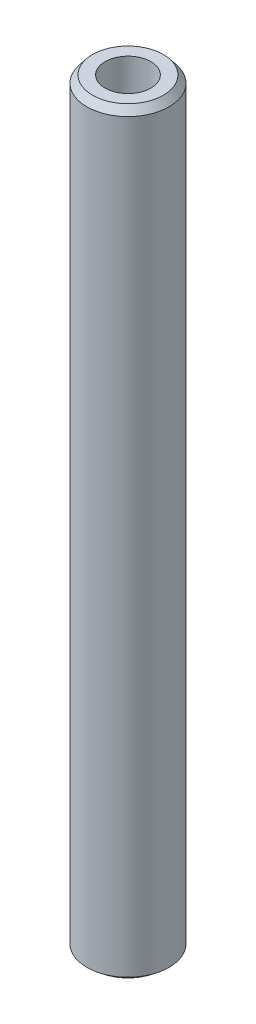
ISO-10303-21;
HEADER;
FILE_DESCRIPTION(('STEP AP214'),'2;1');
FILE_NAME('part.step','',(''),(''),'','','');
FILE_SCHEMA(('AUTOMOTIVE_DESIGN { 1 0 10303 214 1 1 1 1 }'));
ENDSEC;
DATA;
#1=APPLICATION_CONTEXT('core data for automotive mechanical design processes');
#2=APPLICATION_PROTOCOL_DEFINITION('international standard','automotive_design',2000,#1);
#3=PRODUCT_CONTEXT('',#1,'mechanical');
#4=PRODUCT('Part','Part','',(#3));
#5=PRODUCT_RELATED_PRODUCT_CATEGORY('part','',(#4));
#6=PRODUCT_DEFINITION_FORMATION('','',#4);
#7=PRODUCT_DEFINITION_CONTEXT('part definition',#1,'design');
#8=PRODUCT_DEFINITION('design','',#6,#7);
#9=PRODUCT_DEFINITION_SHAPE('','',#8);
#10=(LENGTH_UNIT() NAMED_UNIT(*) SI_UNIT(.MILLI.,.METRE.));
#11=(NAMED_UNIT(*) PLANE_ANGLE_UNIT() SI_UNIT($,.RADIAN.));
#12=(NAMED_UNIT(*) SI_UNIT($,.STERADIAN.) SOLID_ANGLE_UNIT());
#13=UNCERTAINTY_MEASURE_WITH_UNIT(LENGTH_MEASURE(1.E-05),#10,'distance_accuracy_value','');
#14=(GEOMETRIC_REPRESENTATION_CONTEXT(3) GLOBAL_UNCERTAINTY_ASSIGNED_CONTEXT((#13)) GLOBAL_UNIT_ASSIGNED_CONTEXT((#10,
#11,#12)) REPRESENTATION_CONTEXT('',''));
#15=CARTESIAN_POINT('',(0.,0.,0.));
#16=DIRECTION('',(0.,0.,1.));
#17=DIRECTION('',(1.,0.,0.));
#18=AXIS2_PLACEMENT_3D('',#15,#16,#17);
#19=CARTESIAN_POINT('',(0.,600.,0.));
#20=DIRECTION('',(0.,-1.,0.));
#21=DIRECTION('',(0.,0.,-1.));
#22=AXIS2_PLACEMENT_3D('',#19,#20,#21);
#23=CYLINDRICAL_SURFACE('',#22,32.5);
#24=CARTESIAN_POINT('',(0.,594.346347085469,0.));
#25=DIRECTION('',(0.,1.,0.));
#26=DIRECTION('',(0.,0.,1.));
#27=AXIS2_PLACEMENT_3D('',#24,#25,#26);
#28=CIRCLE('',#27,32.5);
#29=CARTESIAN_POINT('',(0.,594.346347085469,32.5));
#30=VERTEX_POINT('',#29);
#31=EDGE_CURVE('E50',#30,#30,#28,.F.);
#32=ORIENTED_EDGE('',*,*,#31,.T.);
#33=EDGE_LOOP('',(#32));
#34=FACE_BOUND('',#33,.T.);
#35=CARTESIAN_POINT('',(0.,4.52250752473493,0.));
#36=DIRECTION('',(0.,1.,0.));
#37=DIRECTION('',(0.,0.,1.));
#38=AXIS2_PLACEMENT_3D('',#35,#36,#37);
#39=CIRCLE('',#38,32.5);
#40=CARTESIAN_POINT('',(0.,4.52250752473493,32.5));
#41=VERTEX_POINT('',#40);
#42=EDGE_CURVE('E51',#41,#41,#39,.T.);
#43=ORIENTED_EDGE('',*,*,#42,.T.);
#44=EDGE_LOOP('',(#43));
#45=FACE_BOUND('',#44,.T.);
#46=ADVANCED_FACE('F39',(#34,#45),#23,.T.);
#47=CARTESIAN_POINT('',(0.,600.,0.));
#48=DIRECTION('',(0.,1.,0.));
#49=DIRECTION('',(0.,0.,1.));
#50=AXIS2_PLACEMENT_3D('',#47,#48,#49);
#51=PLANE('',#50);
#52=CARTESIAN_POINT('',(0.,600.,0.));
#53=DIRECTION('',(0.,1.,0.));
#54=DIRECTION('',(0.,0.,1.));
#55=AXIS2_PLACEMENT_3D('',#52,#53,#54);
#56=CIRCLE('',#55,27.9774924752651);
#57=CARTESIAN_POINT('',(0.,600.,27.9774924752651));
#58=VERTEX_POINT('',#57);
#59=EDGE_CURVE('E54',#58,#58,#56,.T.);
#60=ORIENTED_EDGE('',*,*,#59,.T.);
#61=EDGE_LOOP('',(#60));
#62=FACE_BOUND('',#61,.T.);
#63=CARTESIAN_POINT('',(0.,600.,0.));
#64=DIRECTION('',(0.,1.,0.));
#65=DIRECTION('',(0.,0.,1.));
#66=AXIS2_PLACEMENT_3D('',#63,#64,#65);
#67=CIRCLE('',#66,18.1436030335975);
#68=CARTESIAN_POINT('',(0.,600.,18.1436030335975));
#69=VERTEX_POINT('',#68);
#70=EDGE_CURVE('E58',#69,#69,#67,.T.);
#71=ORIENTED_EDGE('',*,*,#70,.F.);
#72=EDGE_LOOP('',(#71));
#73=FACE_BOUND('',#72,.T.);
#74=ADVANCED_FACE('F69',(#62,#73),#51,.T.);
#75=CARTESIAN_POINT('',(0.,0.,0.));
#76=DIRECTION('',(0.,1.,0.));
#77=DIRECTION('',(0.,0.,1.));
#78=AXIS2_PLACEMENT_3D('',#75,#76,#77);
#79=PLANE('',#78);
#80=CARTESIAN_POINT('',(0.,0.,0.));
#81=DIRECTION('',(0.,1.,0.));
#82=DIRECTION('',(0.,0.,1.));
#83=AXIS2_PLACEMENT_3D('',#80,#81,#82);
#84=CIRCLE('',#83,26.8463470854688);
#85=CARTESIAN_POINT('',(0.,0.,26.8463470854688));
#86=VERTEX_POINT('',#85);
#87=EDGE_CURVE('E10',#86,#86,#84,.F.);
#88=ORIENTED_EDGE('',*,*,#87,.T.);
#89=EDGE_LOOP('',(#88));
#90=FACE_BOUND('',#89,.T.);
#91=CARTESIAN_POINT('',(0.,0.,0.));
#92=DIRECTION('',(0.,1.,0.));
#93=DIRECTION('',(0.,0.,1.));
#94=AXIS2_PLACEMENT_3D('',#91,#92,#93);
#95=CIRCLE('',#94,18.1436030335975);
#96=CARTESIAN_POINT('',(0.,0.,18.1436030335975));
#97=VERTEX_POINT('',#96);
#98=EDGE_CURVE('E63',#97,#97,#95,.T.);
#99=ORIENTED_EDGE('',*,*,#98,.T.);
#100=EDGE_LOOP('',(#99));
#101=FACE_BOUND('',#100,.T.);
#102=ADVANCED_FACE('F75',(#90,#101),#79,.F.);
#103=CARTESIAN_POINT('',(0.,600.,0.));
#104=DIRECTION('',(0.,-1.,0.));
#105=DIRECTION('',(0.,0.,-1.));
#106=AXIS2_PLACEMENT_3D('',#103,#104,#105);
#107=CYLINDRICAL_SURFACE('',#106,18.1436030335975);
#108=ORIENTED_EDGE('',*,*,#70,.T.);
#109=EDGE_LOOP('',(#108));
#110=FACE_BOUND('',#109,.T.);
#111=ORIENTED_EDGE('',*,*,#98,.F.);
#112=EDGE_LOOP('',(#111));
#113=FACE_BOUND('',#112,.T.);
#114=ADVANCED_FACE('F70',(#110,#113),#107,.F.);
#115=CARTESIAN_POINT('',(0.,600.,0.));
#116=DIRECTION('',(0.,-1.,0.));
#117=DIRECTION('',(0.,0.,-1.));
#118=AXIS2_PLACEMENT_3D('',#115,#116,#117);
#119=CONICAL_SURFACE('',#118,27.9774924752651,0.674696202992661);
#120=ORIENTED_EDGE('',*,*,#31,.F.);
#121=EDGE_LOOP('',(#120));
#122=FACE_BOUND('',#121,.T.);
#123=ORIENTED_EDGE('',*,*,#59,.F.);
#124=EDGE_LOOP('',(#123));
#125=FACE_BOUND('',#124,.T.);
#126=ADVANCED_FACE('F81',(#122,#125),#119,.T.);
#127=CARTESIAN_POINT('',(0.,4.52250752473493,0.));
#128=DIRECTION('',(0.,1.,0.));
#129=DIRECTION('',(0.,0.,1.));
#130=AXIS2_PLACEMENT_3D('',#127,#128,#129);
#131=CONICAL_SURFACE('',#130,32.5,0.89610012380223);
#132=ORIENTED_EDGE('',*,*,#87,.F.);
#133=EDGE_LOOP('',(#132));
#134=FACE_BOUND('',#133,.T.);
#135=ORIENTED_EDGE('',*,*,#42,.F.);
#136=EDGE_LOOP('',(#135));
#137=FACE_BOUND('',#136,.T.);
#138=ADVANCED_FACE('F45',(#134,#137),#131,.T.);
#139=CLOSED_SHELL('',(#46,#74,#102,#114,#126,#138));
#140=MANIFOLD_SOLID_BREP('B2',#139);
#141=ADVANCED_BREP_SHAPE_REPRESENTATION('',(#18,#140),#14);
#142=SHAPE_DEFINITION_REPRESENTATION(#9,#141);
ENDSEC;
END-ISO-10303-21;
